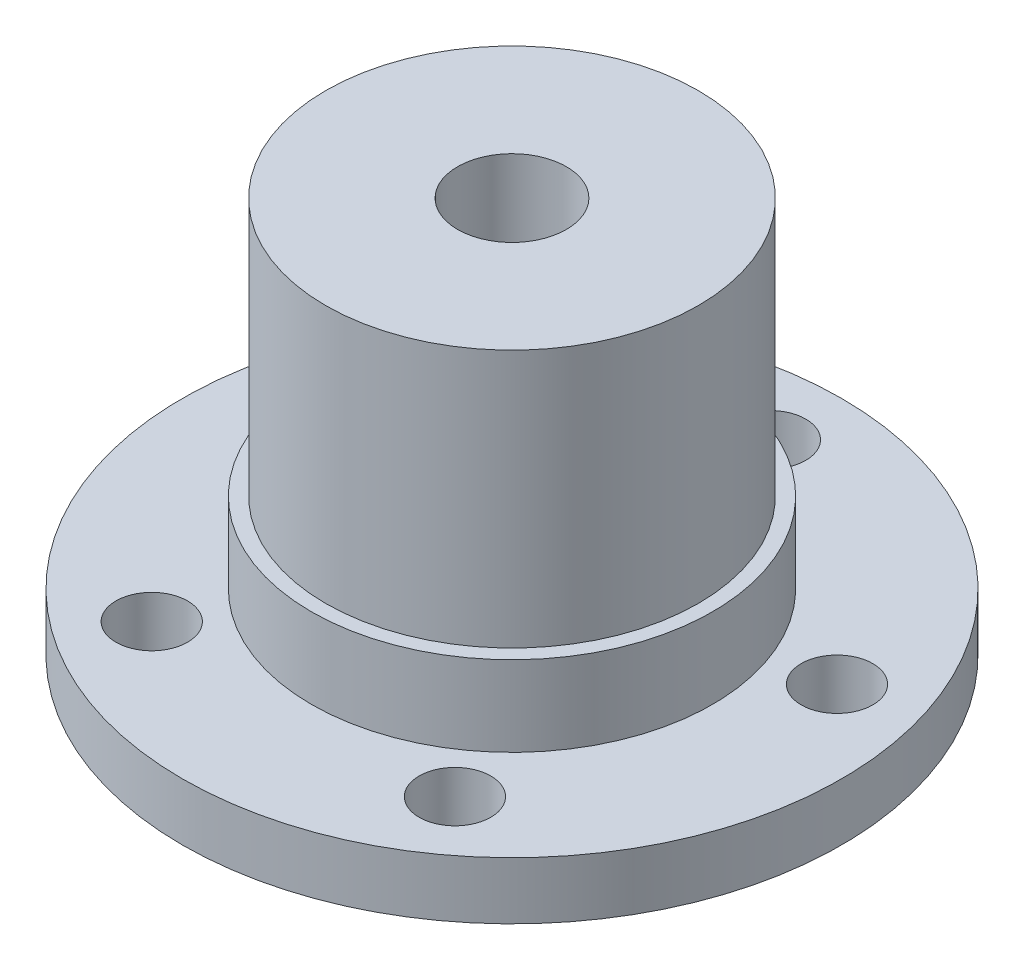
ISO-10303-21;
HEADER;
FILE_DESCRIPTION(('STEP AP214'),'2;1');
FILE_NAME('part.step','',(''),(''),'','','');
FILE_SCHEMA(('AUTOMOTIVE_DESIGN { 1 0 10303 214 1 1 1 1 }'));
ENDSEC;
DATA;
#1=APPLICATION_CONTEXT('core data for automotive mechanical design processes');
#2=APPLICATION_PROTOCOL_DEFINITION('international standard','automotive_design',2000,#1);
#3=PRODUCT_CONTEXT('',#1,'mechanical');
#4=PRODUCT('Part','Part','',(#3));
#5=PRODUCT_RELATED_PRODUCT_CATEGORY('part','',(#4));
#6=PRODUCT_DEFINITION_FORMATION('','',#4);
#7=PRODUCT_DEFINITION_CONTEXT('part definition',#1,'design');
#8=PRODUCT_DEFINITION('design','',#6,#7);
#9=PRODUCT_DEFINITION_SHAPE('','',#8);
#10=(LENGTH_UNIT() NAMED_UNIT(*) SI_UNIT(.MILLI.,.METRE.));
#11=(NAMED_UNIT(*) PLANE_ANGLE_UNIT() SI_UNIT($,.RADIAN.));
#12=(NAMED_UNIT(*) SI_UNIT($,.STERADIAN.) SOLID_ANGLE_UNIT());
#13=UNCERTAINTY_MEASURE_WITH_UNIT(LENGTH_MEASURE(1.E-05),#10,'distance_accuracy_value','');
#14=(GEOMETRIC_REPRESENTATION_CONTEXT(3) GLOBAL_UNCERTAINTY_ASSIGNED_CONTEXT((#13)) GLOBAL_UNIT_ASSIGNED_CONTEXT((#10,
#11,#12)) REPRESENTATION_CONTEXT('',''));
#15=CARTESIAN_POINT('',(0.,0.,0.));
#16=DIRECTION('',(0.,0.,1.));
#17=DIRECTION('',(1.,0.,0.));
#18=AXIS2_PLACEMENT_3D('',#15,#16,#17);
#19=CARTESIAN_POINT('',(0.,13.8025,0.));
#20=DIRECTION('',(0.,1.,0.));
#21=DIRECTION('',(0.,0.,1.));
#22=AXIS2_PLACEMENT_3D('',#19,#20,#21);
#23=PLANE('',#22);
#24=CARTESIAN_POINT('',(0.,13.8025,0.));
#25=DIRECTION('',(0.,1.,0.));
#26=DIRECTION('',(0.,0.,1.));
#27=AXIS2_PLACEMENT_3D('',#24,#25,#26);
#28=CIRCLE('',#27,1.89865);
#29=CARTESIAN_POINT('',(0.,13.8025,1.89865));
#30=VERTEX_POINT('',#29);
#31=EDGE_CURVE('E96',#30,#30,#28,.T.);
#32=ORIENTED_EDGE('',*,*,#31,.F.);
#33=EDGE_LOOP('',(#32));
#34=FACE_BOUND('',#33,.T.);
#35=CARTESIAN_POINT('',(0.,13.8025,0.));
#36=DIRECTION('',(0.,-1.,0.));
#37=DIRECTION('',(0.,0.,-1.));
#38=AXIS2_PLACEMENT_3D('',#35,#36,#37);
#39=CIRCLE('',#38,6.5);
#40=CARTESIAN_POINT('',(0.,13.8025,-6.5));
#41=VERTEX_POINT('',#40);
#42=EDGE_CURVE('E10',#41,#41,#39,.T.);
#43=ORIENTED_EDGE('',*,*,#42,.F.);
#44=EDGE_LOOP('',(#43));
#45=FACE_BOUND('',#44,.T.);
#46=ADVANCED_FACE('F35',(#34,#45),#23,.T.);
#47=CARTESIAN_POINT('',(0.,0.,0.));
#48=DIRECTION('',(0.,-1.,0.));
#49=DIRECTION('',(0.,0.,-1.));
#50=AXIS2_PLACEMENT_3D('',#47,#48,#49);
#51=CYLINDRICAL_SURFACE('',#50,6.5);
#52=ORIENTED_EDGE('',*,*,#42,.T.);
#53=EDGE_LOOP('',(#52));
#54=FACE_BOUND('',#53,.T.);
#55=CARTESIAN_POINT('',(0.,4.8,0.));
#56=DIRECTION('',(0.,-1.,0.));
#57=DIRECTION('',(0.,0.,-1.));
#58=AXIS2_PLACEMENT_3D('',#55,#56,#57);
#59=CIRCLE('',#58,6.5);
#60=CARTESIAN_POINT('',(0.,4.8,-6.5));
#61=VERTEX_POINT('',#60);
#62=EDGE_CURVE('E42',#61,#61,#59,.T.);
#63=ORIENTED_EDGE('',*,*,#62,.F.);
#64=EDGE_LOOP('',(#63));
#65=FACE_BOUND('',#64,.T.);
#66=ADVANCED_FACE('F104',(#54,#65),#51,.T.);
#67=CARTESIAN_POINT('',(6.5,4.8,0.));
#68=DIRECTION('',(0.,1.,0.));
#69=DIRECTION('',(0.,0.,1.));
#70=AXIS2_PLACEMENT_3D('',#67,#68,#69);
#71=PLANE('',#70);
#72=ORIENTED_EDGE('',*,*,#62,.T.);
#73=EDGE_LOOP('',(#72));
#74=FACE_BOUND('',#73,.T.);
#75=CARTESIAN_POINT('',(0.,4.8,0.));
#76=DIRECTION('',(0.,-1.,0.));
#77=DIRECTION('',(0.,0.,-1.));
#78=AXIS2_PLACEMENT_3D('',#75,#76,#77);
#79=CIRCLE('',#78,7.);
#80=CARTESIAN_POINT('',(0.,4.8,-7.));
#81=VERTEX_POINT('',#80);
#82=EDGE_CURVE('E46',#81,#81,#79,.T.);
#83=ORIENTED_EDGE('',*,*,#82,.F.);
#84=EDGE_LOOP('',(#83));
#85=FACE_BOUND('',#84,.T.);
#86=ADVANCED_FACE('F108',(#74,#85),#71,.T.);
#87=CARTESIAN_POINT('',(0.,0.,0.));
#88=DIRECTION('',(0.,-1.,0.));
#89=DIRECTION('',(0.,0.,-1.));
#90=AXIS2_PLACEMENT_3D('',#87,#88,#89);
#91=CYLINDRICAL_SURFACE('',#90,7.);
#92=ORIENTED_EDGE('',*,*,#82,.T.);
#93=EDGE_LOOP('',(#92));
#94=FACE_BOUND('',#93,.T.);
#95=CARTESIAN_POINT('',(0.,2.,0.));
#96=DIRECTION('',(0.,-1.,0.));
#97=DIRECTION('',(0.,0.,-1.));
#98=AXIS2_PLACEMENT_3D('',#95,#96,#97);
#99=CIRCLE('',#98,7.);
#100=CARTESIAN_POINT('',(0.,2.,-7.));
#101=VERTEX_POINT('',#100);
#102=EDGE_CURVE('E51',#101,#101,#99,.T.);
#103=ORIENTED_EDGE('',*,*,#102,.F.);
#104=EDGE_LOOP('',(#103));
#105=FACE_BOUND('',#104,.T.);
#106=ADVANCED_FACE('F112',(#94,#105),#91,.T.);
#107=CARTESIAN_POINT('',(7.,2.,0.));
#108=DIRECTION('',(0.,1.,0.));
#109=DIRECTION('',(0.,0.,1.));
#110=AXIS2_PLACEMENT_3D('',#107,#108,#109);
#111=PLANE('',#110);
#112=CARTESIAN_POINT('',(0.,2.,-9.));
#113=DIRECTION('',(0.,1.,0.));
#114=DIRECTION('',(0.,0.,1.));
#115=AXIS2_PLACEMENT_3D('',#112,#113,#114);
#116=CIRCLE('',#115,1.24999999999999);
#117=CARTESIAN_POINT('',(0.,2.,-7.75000000000001));
#118=VERTEX_POINT('',#117);
#119=EDGE_CURVE('E87',#118,#118,#116,.T.);
#120=ORIENTED_EDGE('',*,*,#119,.F.);
#121=EDGE_LOOP('',(#120));
#122=FACE_BOUND('',#121,.T.);
#123=CARTESIAN_POINT('',(-8.55950864665665,2.,-2.78115294937489));
#124=DIRECTION('',(0.,1.,0.));
#125=DIRECTION('',(0.,0.,1.));
#126=AXIS2_PLACEMENT_3D('',#123,#124,#125);
#127=CIRCLE('',#126,1.24999999999999);
#128=CARTESIAN_POINT('',(-8.55950864665665,2.,-1.5311529493749));
#129=VERTEX_POINT('',#128);
#130=EDGE_CURVE('E81',#129,#129,#127,.T.);
#131=ORIENTED_EDGE('',*,*,#130,.F.);
#132=EDGE_LOOP('',(#131));
#133=FACE_BOUND('',#132,.T.);
#134=CARTESIAN_POINT('',(-5.29006727063295,2.,7.2811529493743));
#135=DIRECTION('',(0.,1.,0.));
#136=DIRECTION('',(0.,0.,1.));
#137=AXIS2_PLACEMENT_3D('',#134,#135,#136);
#138=CIRCLE('',#137,1.24999999999999);
#139=CARTESIAN_POINT('',(-5.29006727063295,2.,8.53115294937429));
#140=VERTEX_POINT('',#139);
#141=EDGE_CURVE('E75',#140,#140,#138,.T.);
#142=ORIENTED_EDGE('',*,*,#141,.F.);
#143=EDGE_LOOP('',(#142));
#144=FACE_BOUND('',#143,.T.);
#145=CARTESIAN_POINT('',(5.29006727063157,2.,7.28115294937475));
#146=DIRECTION('',(0.,1.,0.));
#147=DIRECTION('',(0.,0.,1.));
#148=AXIS2_PLACEMENT_3D('',#145,#146,#147);
#149=CIRCLE('',#148,1.24999999999999);
#150=CARTESIAN_POINT('',(5.29006727063157,2.,8.53115294937474));
#151=VERTEX_POINT('',#150);
#152=EDGE_CURVE('E69',#151,#151,#149,.T.);
#153=ORIENTED_EDGE('',*,*,#152,.F.);
#154=EDGE_LOOP('',(#153));
#155=FACE_BOUND('',#154,.T.);
#156=CARTESIAN_POINT('',(8.55950864665612,2.,-2.78115294937416));
#157=DIRECTION('',(0.,1.,0.));
#158=DIRECTION('',(0.,0.,1.));
#159=AXIS2_PLACEMENT_3D('',#156,#157,#158);
#160=CIRCLE('',#159,1.24999999999999);
#161=CARTESIAN_POINT('',(8.55950864665612,2.,-1.53115294937417));
#162=VERTEX_POINT('',#161);
#163=EDGE_CURVE('E63',#162,#162,#160,.T.);
#164=ORIENTED_EDGE('',*,*,#163,.F.);
#165=EDGE_LOOP('',(#164));
#166=FACE_BOUND('',#165,.T.);
#167=ORIENTED_EDGE('',*,*,#102,.T.);
#168=EDGE_LOOP('',(#167));
#169=FACE_BOUND('',#168,.T.);
#170=CARTESIAN_POINT('',(0.,2.,0.));
#171=DIRECTION('',(0.,-1.,0.));
#172=DIRECTION('',(0.,0.,-1.));
#173=AXIS2_PLACEMENT_3D('',#170,#171,#172);
#174=CIRCLE('',#173,11.5);
#175=CARTESIAN_POINT('',(0.,2.,-11.5));
#176=VERTEX_POINT('',#175);
#177=EDGE_CURVE('E54',#176,#176,#174,.T.);
#178=ORIENTED_EDGE('',*,*,#177,.F.);
#179=EDGE_LOOP('',(#178));
#180=FACE_BOUND('',#179,.T.);
#181=ADVANCED_FACE('F119',(#122,#133,#144,#155,#166,#169,#180),#111,.T.);
#182=CARTESIAN_POINT('',(0.,0.,0.));
#183=DIRECTION('',(0.,-1.,0.));
#184=DIRECTION('',(0.,0.,-1.));
#185=AXIS2_PLACEMENT_3D('',#182,#183,#184);
#186=CYLINDRICAL_SURFACE('',#185,11.5);
#187=ORIENTED_EDGE('',*,*,#177,.T.);
#188=EDGE_LOOP('',(#187));
#189=FACE_BOUND('',#188,.T.);
#190=CARTESIAN_POINT('',(0.,0.,0.));
#191=DIRECTION('',(0.,-1.,0.));
#192=DIRECTION('',(0.,0.,-1.));
#193=AXIS2_PLACEMENT_3D('',#190,#191,#192);
#194=CIRCLE('',#193,11.5);
#195=CARTESIAN_POINT('',(0.,0.,-11.5));
#196=VERTEX_POINT('',#195);
#197=EDGE_CURVE('E57',#196,#196,#194,.T.);
#198=ORIENTED_EDGE('',*,*,#197,.F.);
#199=EDGE_LOOP('',(#198));
#200=FACE_BOUND('',#199,.T.);
#201=ADVANCED_FACE('F123',(#189,#200),#186,.T.);
#202=CARTESIAN_POINT('',(11.5,0.,0.));
#203=DIRECTION('',(0.,-1.,0.));
#204=DIRECTION('',(0.,0.,-1.));
#205=AXIS2_PLACEMENT_3D('',#202,#203,#204);
#206=PLANE('',#205);
#207=CARTESIAN_POINT('',(0.,0.,-9.));
#208=DIRECTION('',(0.,-1.,0.));
#209=DIRECTION('',(0.,0.,-1.));
#210=AXIS2_PLACEMENT_3D('',#207,#208,#209);
#211=CIRCLE('',#210,1.24999999999999);
#212=CARTESIAN_POINT('',(0.,0.,-10.25));
#213=VERTEX_POINT('',#212);
#214=EDGE_CURVE('E90',#213,#213,#211,.T.);
#215=ORIENTED_EDGE('',*,*,#214,.F.);
#216=EDGE_LOOP('',(#215));
#217=FACE_BOUND('',#216,.T.);
#218=CARTESIAN_POINT('',(-8.55950864665665,0.,-2.78115294937489));
#219=DIRECTION('',(0.,-1.,0.));
#220=DIRECTION('',(0.,0.,-1.));
#221=AXIS2_PLACEMENT_3D('',#218,#219,#220);
#222=CIRCLE('',#221,1.24999999999999);
#223=CARTESIAN_POINT('',(-8.55950864665665,0.,-4.03115294937488));
#224=VERTEX_POINT('',#223);
#225=EDGE_CURVE('E84',#224,#224,#222,.T.);
#226=ORIENTED_EDGE('',*,*,#225,.F.);
#227=EDGE_LOOP('',(#226));
#228=FACE_BOUND('',#227,.T.);
#229=CARTESIAN_POINT('',(-5.29006727063295,0.,7.2811529493743));
#230=DIRECTION('',(0.,-1.,0.));
#231=DIRECTION('',(0.,0.,-1.));
#232=AXIS2_PLACEMENT_3D('',#229,#230,#231);
#233=CIRCLE('',#232,1.24999999999999);
#234=CARTESIAN_POINT('',(-5.29006727063295,0.,6.03115294937431));
#235=VERTEX_POINT('',#234);
#236=EDGE_CURVE('E78',#235,#235,#233,.T.);
#237=ORIENTED_EDGE('',*,*,#236,.F.);
#238=EDGE_LOOP('',(#237));
#239=FACE_BOUND('',#238,.T.);
#240=CARTESIAN_POINT('',(5.29006727063157,0.,7.28115294937475));
#241=DIRECTION('',(0.,-1.,0.));
#242=DIRECTION('',(0.,0.,-1.));
#243=AXIS2_PLACEMENT_3D('',#240,#241,#242);
#244=CIRCLE('',#243,1.24999999999999);
#245=CARTESIAN_POINT('',(5.29006727063157,0.,6.03115294937477));
#246=VERTEX_POINT('',#245);
#247=EDGE_CURVE('E72',#246,#246,#244,.T.);
#248=ORIENTED_EDGE('',*,*,#247,.F.);
#249=EDGE_LOOP('',(#248));
#250=FACE_BOUND('',#249,.T.);
#251=CARTESIAN_POINT('',(8.55950864665612,0.,-2.78115294937416));
#252=DIRECTION('',(0.,-1.,0.));
#253=DIRECTION('',(0.,0.,-1.));
#254=AXIS2_PLACEMENT_3D('',#251,#252,#253);
#255=CIRCLE('',#254,1.24999999999999);
#256=CARTESIAN_POINT('',(8.55950864665612,0.,-4.03115294937415));
#257=VERTEX_POINT('',#256);
#258=EDGE_CURVE('E66',#257,#257,#255,.T.);
#259=ORIENTED_EDGE('',*,*,#258,.F.);
#260=EDGE_LOOP('',(#259));
#261=FACE_BOUND('',#260,.T.);
#262=CARTESIAN_POINT('',(-3.82039804131605E-13,0.,0.));
#263=DIRECTION('',(0.,-1.,0.));
#264=DIRECTION('',(0.,0.,-1.));
#265=AXIS2_PLACEMENT_3D('',#262,#263,#264);
#266=CIRCLE('',#265,1.25000000000037);
#267=CARTESIAN_POINT('',(-3.82039804131605E-13,0.,-1.25000000000037));
#268=VERTEX_POINT('',#267);
#269=EDGE_CURVE('E60',#268,#268,#266,.T.);
#270=ORIENTED_EDGE('',*,*,#269,.F.);
#271=EDGE_LOOP('',(#270));
#272=FACE_BOUND('',#271,.T.);
#273=ORIENTED_EDGE('',*,*,#197,.T.);
#274=EDGE_LOOP('',(#273));
#275=FACE_BOUND('',#274,.T.);
#276=ADVANCED_FACE('F127',(#217,#228,#239,#250,#261,#272,#275),#206,.T.);
#277=CARTESIAN_POINT('',(-3.82039804131605E-13,0.,0.));
#278=DIRECTION('',(0.,-1.,0.));
#279=DIRECTION('',(0.,0.,-1.));
#280=AXIS2_PLACEMENT_3D('',#277,#278,#279);
#281=CYLINDRICAL_SURFACE('',#280,1.25000000000037);
#282=CARTESIAN_POINT('',(0.,0.712751759468,0.));
#283=DIRECTION('',(0.,1.,0.));
#284=DIRECTION('',(0.,0.,1.));
#285=AXIS2_PLACEMENT_3D('',#282,#283,#284);
#286=CIRCLE('',#285,1.25000000000037);
#287=CARTESIAN_POINT('',(0.,0.712751759468,1.25000000000037));
#288=VERTEX_POINT('',#287);
#289=EDGE_CURVE('E38',#288,#288,#286,.T.);
#290=ORIENTED_EDGE('',*,*,#289,.T.);
#291=EDGE_LOOP('',(#290));
#292=FACE_BOUND('',#291,.T.);
#293=ORIENTED_EDGE('',*,*,#269,.T.);
#294=EDGE_LOOP('',(#293));
#295=FACE_BOUND('',#294,.T.);
#296=ADVANCED_FACE('F131',(#292,#295),#281,.F.);
#297=CARTESIAN_POINT('',(8.55950864665612,0.,-2.78115294937416));
#298=DIRECTION('',(0.,-1.,0.));
#299=DIRECTION('',(0.,0.,-1.));
#300=AXIS2_PLACEMENT_3D('',#297,#298,#299);
#301=CYLINDRICAL_SURFACE('',#300,1.24999999999999);
#302=ORIENTED_EDGE('',*,*,#163,.T.);
#303=EDGE_LOOP('',(#302));
#304=FACE_BOUND('',#303,.T.);
#305=ORIENTED_EDGE('',*,*,#258,.T.);
#306=EDGE_LOOP('',(#305));
#307=FACE_BOUND('',#306,.T.);
#308=ADVANCED_FACE('F135',(#304,#307),#301,.F.);
#309=CARTESIAN_POINT('',(5.29006727063157,0.,7.28115294937475));
#310=DIRECTION('',(0.,-1.,0.));
#311=DIRECTION('',(0.,0.,-1.));
#312=AXIS2_PLACEMENT_3D('',#309,#310,#311);
#313=CYLINDRICAL_SURFACE('',#312,1.24999999999999);
#314=ORIENTED_EDGE('',*,*,#152,.T.);
#315=EDGE_LOOP('',(#314));
#316=FACE_BOUND('',#315,.T.);
#317=ORIENTED_EDGE('',*,*,#247,.T.);
#318=EDGE_LOOP('',(#317));
#319=FACE_BOUND('',#318,.T.);
#320=ADVANCED_FACE('F139',(#316,#319),#313,.F.);
#321=CARTESIAN_POINT('',(-5.29006727063295,0.,7.2811529493743));
#322=DIRECTION('',(0.,-1.,0.));
#323=DIRECTION('',(0.,0.,-1.));
#324=AXIS2_PLACEMENT_3D('',#321,#322,#323);
#325=CYLINDRICAL_SURFACE('',#324,1.24999999999999);
#326=ORIENTED_EDGE('',*,*,#141,.T.);
#327=EDGE_LOOP('',(#326));
#328=FACE_BOUND('',#327,.T.);
#329=ORIENTED_EDGE('',*,*,#236,.T.);
#330=EDGE_LOOP('',(#329));
#331=FACE_BOUND('',#330,.T.);
#332=ADVANCED_FACE('F143',(#328,#331),#325,.F.);
#333=CARTESIAN_POINT('',(-8.55950864665665,0.,-2.78115294937489));
#334=DIRECTION('',(0.,-1.,0.));
#335=DIRECTION('',(0.,0.,-1.));
#336=AXIS2_PLACEMENT_3D('',#333,#334,#335);
#337=CYLINDRICAL_SURFACE('',#336,1.24999999999999);
#338=ORIENTED_EDGE('',*,*,#130,.T.);
#339=EDGE_LOOP('',(#338));
#340=FACE_BOUND('',#339,.T.);
#341=ORIENTED_EDGE('',*,*,#225,.T.);
#342=EDGE_LOOP('',(#341));
#343=FACE_BOUND('',#342,.T.);
#344=ADVANCED_FACE('F147',(#340,#343),#337,.F.);
#345=CARTESIAN_POINT('',(0.,0.,-9.));
#346=DIRECTION('',(0.,-1.,0.));
#347=DIRECTION('',(0.,0.,-1.));
#348=AXIS2_PLACEMENT_3D('',#345,#346,#347);
#349=CYLINDRICAL_SURFACE('',#348,1.24999999999999);
#350=ORIENTED_EDGE('',*,*,#119,.T.);
#351=EDGE_LOOP('',(#350));
#352=FACE_BOUND('',#351,.T.);
#353=ORIENTED_EDGE('',*,*,#214,.T.);
#354=EDGE_LOOP('',(#353));
#355=FACE_BOUND('',#354,.T.);
#356=ADVANCED_FACE('F151',(#352,#355),#349,.F.);
#357=CARTESIAN_POINT('',(0.,1.1025,0.));
#358=DIRECTION('',(0.,1.,0.));
#359=DIRECTION('',(0.,0.,1.));
#360=AXIS2_PLACEMENT_3D('',#357,#358,#359);
#361=CONICAL_SURFACE('',#360,1.89865,1.02974425867665);
#362=CARTESIAN_POINT('',(0.,1.1025,0.));
#363=DIRECTION('',(0.,1.,0.));
#364=DIRECTION('',(0.,0.,1.));
#365=AXIS2_PLACEMENT_3D('',#362,#363,#364);
#366=CIRCLE('',#365,1.89865);
#367=CARTESIAN_POINT('',(0.,1.1025,1.89865));
#368=VERTEX_POINT('',#367);
#369=EDGE_CURVE('E93',#368,#368,#366,.T.);
#370=ORIENTED_EDGE('',*,*,#369,.T.);
#371=EDGE_LOOP('',(#370));
#372=FACE_BOUND('',#371,.T.);
#373=ORIENTED_EDGE('',*,*,#289,.F.);
#374=EDGE_LOOP('',(#373));
#375=FACE_BOUND('',#374,.T.);
#376=ADVANCED_FACE('F155',(#372,#375),#361,.F.);
#377=CARTESIAN_POINT('',(0.,13.8025,0.));
#378=DIRECTION('',(0.,1.,0.));
#379=DIRECTION('',(0.,0.,1.));
#380=AXIS2_PLACEMENT_3D('',#377,#378,#379);
#381=CYLINDRICAL_SURFACE('',#380,1.89865);
#382=ORIENTED_EDGE('',*,*,#369,.F.);
#383=EDGE_LOOP('',(#382));
#384=FACE_BOUND('',#383,.T.);
#385=ORIENTED_EDGE('',*,*,#31,.T.);
#386=EDGE_LOOP('',(#385));
#387=FACE_BOUND('',#386,.T.);
#388=ADVANCED_FACE('F100',(#384,#387),#381,.F.);
#389=CLOSED_SHELL('',(#46,#66,#86,#106,#181,#201,#276,#296,#308,#320,#332,#344,#356,#376,#388));
#390=MANIFOLD_SOLID_BREP('B2',#389);
#391=ADVANCED_BREP_SHAPE_REPRESENTATION('',(#18,#390),#14);
#392=SHAPE_DEFINITION_REPRESENTATION(#9,#391);
ENDSEC;
END-ISO-10303-21;
